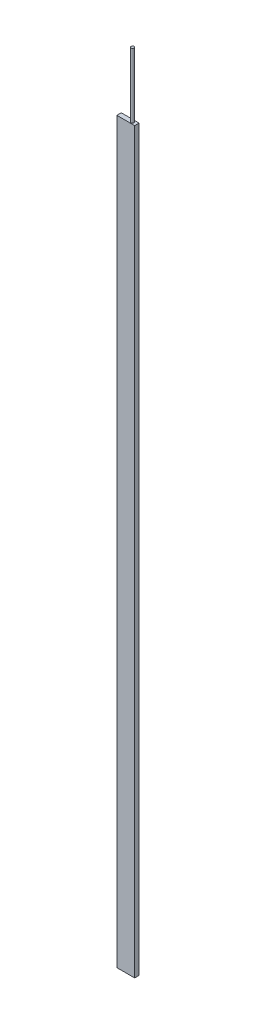
ISO-10303-21;
HEADER;
FILE_DESCRIPTION(('STEP AP214'),'2;1');
FILE_NAME('part.step','',(''),(''),'','','');
FILE_SCHEMA(('AUTOMOTIVE_DESIGN { 1 0 10303 214 1 1 1 1 }'));
ENDSEC;
DATA;
#1=APPLICATION_CONTEXT('core data for automotive mechanical design processes');
#2=APPLICATION_PROTOCOL_DEFINITION('international standard','automotive_design',2000,#1);
#3=PRODUCT_CONTEXT('',#1,'mechanical');
#4=PRODUCT('Part','Part','',(#3));
#5=PRODUCT_RELATED_PRODUCT_CATEGORY('part','',(#4));
#6=PRODUCT_DEFINITION_FORMATION('','',#4);
#7=PRODUCT_DEFINITION_CONTEXT('part definition',#1,'design');
#8=PRODUCT_DEFINITION('design','',#6,#7);
#9=PRODUCT_DEFINITION_SHAPE('','',#8);
#10=(LENGTH_UNIT() NAMED_UNIT(*) SI_UNIT(.MILLI.,.METRE.));
#11=(NAMED_UNIT(*) PLANE_ANGLE_UNIT() SI_UNIT($,.RADIAN.));
#12=(NAMED_UNIT(*) SI_UNIT($,.STERADIAN.) SOLID_ANGLE_UNIT());
#13=UNCERTAINTY_MEASURE_WITH_UNIT(LENGTH_MEASURE(1.E-05),#10,'distance_accuracy_value','');
#14=(GEOMETRIC_REPRESENTATION_CONTEXT(3) GLOBAL_UNCERTAINTY_ASSIGNED_CONTEXT((#13)) GLOBAL_UNIT_ASSIGNED_CONTEXT((#10,
#11,#12)) REPRESENTATION_CONTEXT('',''));
#15=CARTESIAN_POINT('',(0.,0.,0.));
#16=DIRECTION('',(0.,0.,1.));
#17=DIRECTION('',(1.,0.,0.));
#18=AXIS2_PLACEMENT_3D('',#15,#16,#17);
#19=CARTESIAN_POINT('',(69.0118000000002,5710.,-17.0560999999999));
#20=DIRECTION('',(-1.,0.,0.));
#21=DIRECTION('',(0.,0.,1.));
#22=AXIS2_PLACEMENT_3D('',#19,#20,#21);
#23=PLANE('',#22);
#24=DIRECTION('',(0.,0.,-1.));
#25=VECTOR('',#24,1.);
#26=CARTESIAN_POINT('',(69.0118000000002,0.,-17.0560999999999));
#27=LINE('',#26,#25);
#28=CARTESIAN_POINT('',(69.0117999999997,0.,17.0561000000001));
#29=VERTEX_POINT('',#28);
#30=CARTESIAN_POINT('',(69.0118000000002,0.,-17.0560999999999));
#31=VERTEX_POINT('',#30);
#32=EDGE_CURVE('E100',#29,#31,#27,.T.);
#33=ORIENTED_EDGE('',*,*,#32,.T.);
#34=DIRECTION('',(0.,-1.,0.));
#35=VECTOR('',#34,1.);
#36=CARTESIAN_POINT('',(69.0118000000002,5710.,-17.0560999999999));
#37=LINE('',#36,#35);
#38=CARTESIAN_POINT('',(69.0118000000002,5710.,-17.0560999999999));
#39=VERTEX_POINT('',#38);
#40=EDGE_CURVE('E11',#39,#31,#37,.T.);
#41=ORIENTED_EDGE('',*,*,#40,.F.);
#42=DIRECTION('',(0.,0.,-1.));
#43=VECTOR('',#42,1.);
#44=CARTESIAN_POINT('',(69.0118000000002,5710.,-17.0560999999999));
#45=LINE('',#44,#43);
#46=CARTESIAN_POINT('',(69.0117999999997,5710.,17.0561000000001));
#47=VERTEX_POINT('',#46);
#48=EDGE_CURVE('E88',#47,#39,#45,.T.);
#49=ORIENTED_EDGE('',*,*,#48,.F.);
#50=DIRECTION('',(0.,-1.,0.));
#51=VECTOR('',#50,1.);
#52=CARTESIAN_POINT('',(69.0117999999997,5710.,17.0561000000001));
#53=LINE('',#52,#51);
#54=EDGE_CURVE('E96',#47,#29,#53,.T.);
#55=ORIENTED_EDGE('',*,*,#54,.T.);
#56=EDGE_LOOP('',(#33,#41,#49,#55));
#57=FACE_BOUND('',#56,.T.);
#58=ADVANCED_FACE('F37',(#57),#23,.F.);
#59=CARTESIAN_POINT('',(-69.0117999999993,5710.,-17.0560999999999));
#60=DIRECTION('',(0.,0.,1.));
#61=DIRECTION('',(1.,0.,0.));
#62=AXIS2_PLACEMENT_3D('',#59,#60,#61);
#63=PLANE('',#62);
#64=DIRECTION('',(-1.,0.,0.));
#65=VECTOR('',#64,1.);
#66=CARTESIAN_POINT('',(-69.0117999999993,0.,-17.0560999999999));
#67=LINE('',#66,#65);
#68=CARTESIAN_POINT('',(-69.0117999999993,0.,-17.0560999999999));
#69=VERTEX_POINT('',#68);
#70=EDGE_CURVE('E92',#31,#69,#67,.T.);
#71=ORIENTED_EDGE('',*,*,#70,.T.);
#72=DIRECTION('',(0.,-1.,0.));
#73=VECTOR('',#72,1.);
#74=CARTESIAN_POINT('',(-69.0117999999993,5710.,-17.0560999999999));
#75=LINE('',#74,#73);
#76=CARTESIAN_POINT('',(-69.0117999999993,5710.,-17.0560999999999));
#77=VERTEX_POINT('',#76);
#78=EDGE_CURVE('E45',#77,#69,#75,.T.);
#79=ORIENTED_EDGE('',*,*,#78,.F.);
#80=DIRECTION('',(-1.,0.,0.));
#81=VECTOR('',#80,1.);
#82=CARTESIAN_POINT('',(-69.0117999999993,5710.,-17.0560999999999));
#83=LINE('',#82,#81);
#84=EDGE_CURVE('E83',#39,#77,#83,.T.);
#85=ORIENTED_EDGE('',*,*,#84,.F.);
#86=ORIENTED_EDGE('',*,*,#40,.T.);
#87=EDGE_LOOP('',(#71,#79,#85,#86));
#88=FACE_BOUND('',#87,.T.);
#89=ADVANCED_FACE('F91',(#88),#63,.F.);
#90=CARTESIAN_POINT('',(-69.0117999999993,5710.,-17.0560999999999));
#91=DIRECTION('',(1.,0.,0.));
#92=DIRECTION('',(0.,0.,-1.));
#93=AXIS2_PLACEMENT_3D('',#90,#91,#92);
#94=PLANE('',#93);
#95=DIRECTION('',(0.,0.,1.));
#96=VECTOR('',#95,1.);
#97=CARTESIAN_POINT('',(-69.0117999999993,0.,-17.0560999999999));
#98=LINE('',#97,#96);
#99=CARTESIAN_POINT('',(-69.0117999999997,0.,17.0561000000001));
#100=VERTEX_POINT('',#99);
#101=EDGE_CURVE('E70',#69,#100,#98,.T.);
#102=ORIENTED_EDGE('',*,*,#101,.T.);
#103=DIRECTION('',(0.,-1.,0.));
#104=VECTOR('',#103,1.);
#105=CARTESIAN_POINT('',(-69.0117999999997,5710.,17.0561000000001));
#106=LINE('',#105,#104);
#107=CARTESIAN_POINT('',(-69.0117999999997,5710.,17.0561000000001));
#108=VERTEX_POINT('',#107);
#109=EDGE_CURVE('E93',#108,#100,#106,.T.);
#110=ORIENTED_EDGE('',*,*,#109,.F.);
#111=DIRECTION('',(0.,0.,1.));
#112=VECTOR('',#111,1.);
#113=CARTESIAN_POINT('',(-69.0117999999993,5710.,-17.0560999999999));
#114=LINE('',#113,#112);
#115=EDGE_CURVE('E86',#77,#108,#114,.T.);
#116=ORIENTED_EDGE('',*,*,#115,.F.);
#117=ORIENTED_EDGE('',*,*,#78,.T.);
#118=EDGE_LOOP('',(#102,#110,#116,#117));
#119=FACE_BOUND('',#118,.T.);
#120=ADVANCED_FACE('F94',(#119),#94,.F.);
#121=CARTESIAN_POINT('',(-69.0117999999997,5710.,17.0561000000001));
#122=DIRECTION('',(0.,0.,-1.));
#123=DIRECTION('',(-1.,0.,0.));
#124=AXIS2_PLACEMENT_3D('',#121,#122,#123);
#125=PLANE('',#124);
#126=DIRECTION('',(1.,0.,0.));
#127=VECTOR('',#126,1.);
#128=CARTESIAN_POINT('',(-69.0117999999997,0.,17.0561000000001));
#129=LINE('',#128,#127);
#130=EDGE_CURVE('E76',#100,#29,#129,.T.);
#131=ORIENTED_EDGE('',*,*,#130,.T.);
#132=ORIENTED_EDGE('',*,*,#54,.F.);
#133=DIRECTION('',(1.,0.,0.));
#134=VECTOR('',#133,1.);
#135=CARTESIAN_POINT('',(-69.0117999999997,5710.,17.0561000000001));
#136=LINE('',#135,#134);
#137=EDGE_CURVE('E53',#108,#47,#136,.T.);
#138=ORIENTED_EDGE('',*,*,#137,.F.);
#139=ORIENTED_EDGE('',*,*,#109,.T.);
#140=EDGE_LOOP('',(#131,#132,#138,#139));
#141=FACE_BOUND('',#140,.T.);
#142=ADVANCED_FACE('F108',(#141),#125,.F.);
#143=CARTESIAN_POINT('',(0.,5710.,0.));
#144=DIRECTION('',(0.,1.,0.));
#145=DIRECTION('',(0.,0.,1.));
#146=AXIS2_PLACEMENT_3D('',#143,#144,#145);
#147=PLANE('',#146);
#148=CARTESIAN_POINT('',(35.4584,5710.,0.));
#149=DIRECTION('',(0.,1.,0.));
#150=DIRECTION('',(0.,0.,1.));
#151=AXIS2_PLACEMENT_3D('',#148,#149,#150);
#152=CIRCLE('',#151,11.43);
#153=CARTESIAN_POINT('',(35.4584,5710.,11.43));
#154=VERTEX_POINT('',#153);
#155=EDGE_CURVE('E114',#154,#154,#152,.T.);
#156=ORIENTED_EDGE('',*,*,#155,.F.);
#157=EDGE_LOOP('',(#156));
#158=FACE_BOUND('',#157,.T.);
#159=ORIENTED_EDGE('',*,*,#48,.T.);
#160=ORIENTED_EDGE('',*,*,#84,.T.);
#161=ORIENTED_EDGE('',*,*,#115,.T.);
#162=ORIENTED_EDGE('',*,*,#137,.T.);
#163=EDGE_LOOP('',(#159,#160,#161,#162));
#164=FACE_BOUND('',#163,.T.);
#165=ADVANCED_FACE('F84',(#158,#164),#147,.T.);
#166=CARTESIAN_POINT('',(0.,0.,0.));
#167=DIRECTION('',(0.,1.,0.));
#168=DIRECTION('',(0.,0.,1.));
#169=AXIS2_PLACEMENT_3D('',#166,#167,#168);
#170=PLANE('',#169);
#171=ORIENTED_EDGE('',*,*,#32,.F.);
#172=ORIENTED_EDGE('',*,*,#130,.F.);
#173=ORIENTED_EDGE('',*,*,#101,.F.);
#174=ORIENTED_EDGE('',*,*,#70,.F.);
#175=EDGE_LOOP('',(#171,#172,#173,#174));
#176=FACE_BOUND('',#175,.T.);
#177=ADVANCED_FACE('F111',(#176),#170,.F.);
#178=CARTESIAN_POINT('',(35.4584,6210.,0.));
#179=DIRECTION('',(0.,-1.,0.));
#180=DIRECTION('',(0.,0.,-1.));
#181=AXIS2_PLACEMENT_3D('',#178,#179,#180);
#182=CYLINDRICAL_SURFACE('',#181,11.43);
#183=CARTESIAN_POINT('',(35.4584,6210.,0.));
#184=DIRECTION('',(0.,1.,0.));
#185=DIRECTION('',(0.,0.,1.));
#186=AXIS2_PLACEMENT_3D('',#183,#184,#185);
#187=CIRCLE('',#186,11.43);
#188=CARTESIAN_POINT('',(35.4584,6210.,11.43));
#189=VERTEX_POINT('',#188);
#190=EDGE_CURVE('E103',#189,#189,#187,.T.);
#191=ORIENTED_EDGE('',*,*,#190,.F.);
#192=EDGE_LOOP('',(#191));
#193=FACE_BOUND('',#192,.T.);
#194=ORIENTED_EDGE('',*,*,#155,.T.);
#195=EDGE_LOOP('',(#194));
#196=FACE_BOUND('',#195,.T.);
#197=ADVANCED_FACE('F122',(#193,#196),#182,.T.);
#198=CARTESIAN_POINT('',(35.4584,6210.,0.));
#199=DIRECTION('',(0.,1.,0.));
#200=DIRECTION('',(0.,0.,1.));
#201=AXIS2_PLACEMENT_3D('',#198,#199,#200);
#202=PLANE('',#201);
#203=ORIENTED_EDGE('',*,*,#190,.T.);
#204=EDGE_LOOP('',(#203));
#205=FACE_BOUND('',#204,.T.);
#206=ADVANCED_FACE('F120',(#205),#202,.T.);
#207=CLOSED_SHELL('',(#58,#89,#120,#142,#165,#177,#197,#206));
#208=MANIFOLD_SOLID_BREP('B2',#207);
#209=ADVANCED_BREP_SHAPE_REPRESENTATION('',(#18,#208),#14);
#210=SHAPE_DEFINITION_REPRESENTATION(#9,#209);
ENDSEC;
END-ISO-10303-21;
